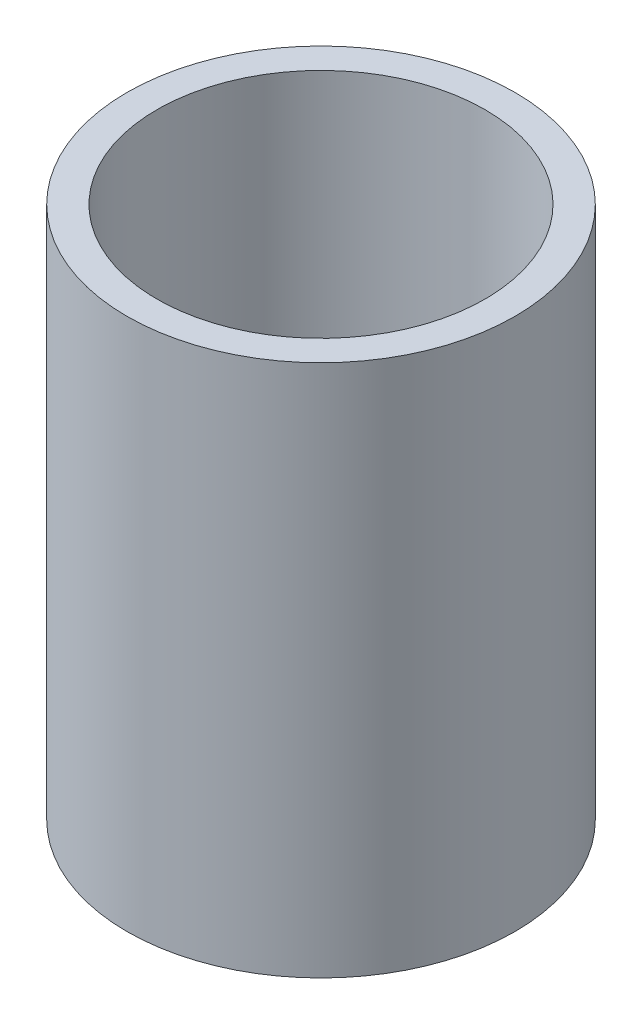
ISO-10303-21;
HEADER;
FILE_DESCRIPTION(('STEP AP214'),'2;1');
FILE_NAME('part.step','',(''),(''),'','','');
FILE_SCHEMA(('AUTOMOTIVE_DESIGN { 1 0 10303 214 1 1 1 1 }'));
ENDSEC;
DATA;
#1=APPLICATION_CONTEXT('core data for automotive mechanical design processes');
#2=APPLICATION_PROTOCOL_DEFINITION('international standard','automotive_design',2000,#1);
#3=PRODUCT_CONTEXT('',#1,'mechanical');
#4=PRODUCT('Part','Part','',(#3));
#5=PRODUCT_RELATED_PRODUCT_CATEGORY('part','',(#4));
#6=PRODUCT_DEFINITION_FORMATION('','',#4);
#7=PRODUCT_DEFINITION_CONTEXT('part definition',#1,'design');
#8=PRODUCT_DEFINITION('design','',#6,#7);
#9=PRODUCT_DEFINITION_SHAPE('','',#8);
#10=(LENGTH_UNIT() NAMED_UNIT(*) SI_UNIT(.MILLI.,.METRE.));
#11=(NAMED_UNIT(*) PLANE_ANGLE_UNIT() SI_UNIT($,.RADIAN.));
#12=(NAMED_UNIT(*) SI_UNIT($,.STERADIAN.) SOLID_ANGLE_UNIT());
#13=UNCERTAINTY_MEASURE_WITH_UNIT(LENGTH_MEASURE(1.E-05),#10,'distance_accuracy_value','');
#14=(GEOMETRIC_REPRESENTATION_CONTEXT(3) GLOBAL_UNCERTAINTY_ASSIGNED_CONTEXT((#13)) GLOBAL_UNIT_ASSIGNED_CONTEXT((#10,
#11,#12)) REPRESENTATION_CONTEXT('',''));
#15=CARTESIAN_POINT('',(0.,0.,0.));
#16=DIRECTION('',(0.,0.,1.));
#17=DIRECTION('',(1.,0.,0.));
#18=AXIS2_PLACEMENT_3D('',#15,#16,#17);
#19=CARTESIAN_POINT('',(0.,157.949440907896,0.));
#20=DIRECTION('',(0.,-1.,0.));
#21=DIRECTION('',(0.,0.,-1.));
#22=AXIS2_PLACEMENT_3D('',#19,#20,#21);
#23=CYLINDRICAL_SURFACE('',#22,57.5);
#24=CARTESIAN_POINT('',(0.,157.949440907896,0.));
#25=DIRECTION('',(0.,1.,0.));
#26=DIRECTION('',(0.,0.,1.));
#27=AXIS2_PLACEMENT_3D('',#24,#25,#26);
#28=CIRCLE('',#27,57.5);
#29=CARTESIAN_POINT('',(0.,157.949440907896,-57.5));
#30=VERTEX_POINT('',#29);
#31=EDGE_CURVE('E10',#30,#30,#28,.T.);
#32=CARTESIAN_POINT('',(0.,0.,0.));
#33=DIRECTION('',(0.,1.,0.));
#34=DIRECTION('',(0.,0.,1.));
#35=AXIS2_PLACEMENT_3D('',#32,#33,#34);
#36=CIRCLE('',#35,57.5);
#37=CARTESIAN_POINT('',(0.,0.,-57.5));
#38=VERTEX_POINT('',#37);
#39=EDGE_CURVE('E37',#38,#38,#36,.T.);
#40=CARTESIAN_POINT('',(0.,157.949440907896,-57.5));
#41=CARTESIAN_POINT('',(0.,156.304134231772,-57.5));
#42=CARTESIAN_POINT('',(0.,154.658827555648,-57.5));
#43=CARTESIAN_POINT('',(0.,151.368214203401,-57.5));
#44=CARTESIAN_POINT('',(0.,149.722907527277,-57.5));
#45=CARTESIAN_POINT('',(0.,146.432294175029,-57.5));
#46=CARTESIAN_POINT('',(0.,144.786987498905,-57.5));
#47=CARTESIAN_POINT('',(0.,141.496374146657,-57.5));
#48=CARTESIAN_POINT('',(0.,139.851067470533,-57.5));
#49=CARTESIAN_POINT('',(0.,136.560454118285,-57.5));
#50=CARTESIAN_POINT('',(0.,134.915147442161,-57.5));
#51=CARTESIAN_POINT('',(0.,131.624534089914,-57.5));
#52=CARTESIAN_POINT('',(0.,129.97922741379,-57.5));
#53=CARTESIAN_POINT('',(0.,126.688614061542,-57.5));
#54=CARTESIAN_POINT('',(0.,125.043307385418,-57.5));
#55=CARTESIAN_POINT('',(0.,121.75269403317,-57.5));
#56=CARTESIAN_POINT('',(0.,120.107387357046,-57.5));
#57=CARTESIAN_POINT('',(0.,116.816774004798,-57.5));
#58=CARTESIAN_POINT('',(0.,115.171467328674,-57.5));
#59=CARTESIAN_POINT('',(0.,111.880853976427,-57.5));
#60=CARTESIAN_POINT('',(0.,110.235547300303,-57.5));
#61=CARTESIAN_POINT('',(0.,106.944933948055,-57.5));
#62=CARTESIAN_POINT('',(0.,105.299627271931,-57.5));
#63=CARTESIAN_POINT('',(0.,102.009013919683,-57.5));
#64=CARTESIAN_POINT('',(0.,100.363707243559,-57.5));
#65=CARTESIAN_POINT('',(0.,97.0730938913113,-57.5));
#66=CARTESIAN_POINT('',(0.,95.4277872151874,-57.5));
#67=CARTESIAN_POINT('',(0.,92.1371738629395,-57.5));
#68=CARTESIAN_POINT('',(0.,90.4918671868156,-57.5));
#69=CARTESIAN_POINT('',(0.,87.2012538345678,-57.5));
#70=CARTESIAN_POINT('',(0.,85.5559471584438,-57.5));
#71=CARTESIAN_POINT('',(0.,82.265333806196,-57.5));
#72=CARTESIAN_POINT('',(0.,80.6200271300721,-57.5));
#73=CARTESIAN_POINT('',(0.,77.3294137778242,-57.5));
#74=CARTESIAN_POINT('',(0.,75.6841071017003,-57.5));
#75=CARTESIAN_POINT('',(0.,72.3934937494525,-57.5));
#76=CARTESIAN_POINT('',(0.,70.7481870733286,-57.5));
#77=CARTESIAN_POINT('',(0.,67.4575737210807,-57.5));
#78=CARTESIAN_POINT('',(0.,65.8122670449568,-57.5));
#79=CARTESIAN_POINT('',(0.,62.521653692709,-57.5));
#80=CARTESIAN_POINT('',(0.,60.876347016585,-57.5));
#81=CARTESIAN_POINT('',(0.,57.5857336643372,-57.5));
#82=CARTESIAN_POINT('',(0.,55.9404269882133,-57.5));
#83=CARTESIAN_POINT('',(0.,52.6498136359654,-57.5));
#84=CARTESIAN_POINT('',(0.,51.0045069598415,-57.5));
#85=CARTESIAN_POINT('',(0.,47.7138936075937,-57.5));
#86=CARTESIAN_POINT('',(0.,46.0685869314698,-57.5));
#87=CARTESIAN_POINT('',(0.,42.7779735792219,-57.5));
#88=CARTESIAN_POINT('',(0.,41.132666903098,-57.5));
#89=CARTESIAN_POINT('',(0.,37.8420535508502,-57.5));
#90=CARTESIAN_POINT('',(0.,36.1967468747262,-57.5));
#91=CARTESIAN_POINT('',(0.,32.9061335224784,-57.5));
#92=CARTESIAN_POINT('',(0.,31.2608268463545,-57.5));
#93=CARTESIAN_POINT('',(0.,27.9702134941066,-57.5));
#94=CARTESIAN_POINT('',(0.,26.3249068179827,-57.5));
#95=CARTESIAN_POINT('',(0.,23.0342934657349,-57.5));
#96=CARTESIAN_POINT('',(0.,21.3889867896109,-57.5));
#97=CARTESIAN_POINT('',(0.,18.0983734373631,-57.5));
#98=CARTESIAN_POINT('',(0.,16.4530667612392,-57.5));
#99=CARTESIAN_POINT('',(0.,13.1624534089913,-57.5));
#100=CARTESIAN_POINT('',(0.,11.5171467328674,-57.5));
#101=CARTESIAN_POINT('',(0.,8.22653338061957,-57.5));
#102=CARTESIAN_POINT('',(0.,6.58122670449565,-57.5));
#103=CARTESIAN_POINT('',(0.,3.29061335224781,-57.5));
#104=CARTESIAN_POINT('',(0.,1.64530667612389,-57.5));
#105=CARTESIAN_POINT('',(0.,0.,-57.5));
#106=B_SPLINE_CURVE_WITH_KNOTS('',3,(#40,#41,#42,#43,#44,#45,#46,#47,#48,#49,#50,#51,#52,#53,
#54,#55,#56,#57,#58,#59,#60,#61,#62,#63,#64,#65,#66,#67,#68,#69,#70,#71,#72,#73,#74,#75,#76,#77,
#78,#79,#80,#81,#82,#83,#84,#85,#86,#87,#88,#89,#90,#91,#92,#93,#94,#95,#96,#97,#98,#99,#100,
#101,#102,#103,#104,#105),.UNSPECIFIED.,.F.,.F.,(4,2,2,2,2,2,2,2,2,2,2,2,2,2,2,2,2,2,2,2,2,2,2,
2,2,2,2,2,2,2,2,2,4),(0.,4.93592002837176,9.87184005674352,14.8077600851153,19.743680113487,
24.6796001418588,29.6155201702306,34.5514401986023,39.4873602269741,44.4232802553458,
49.3592002837176,54.2951203120894,59.2310403404611,64.1669603688329,69.1028803972046,
74.0388004255764,78.9747204539482,83.9106404823199,88.8465605106917,93.7824805390635,
98.7184005674352,103.654320595807,108.590240624179,113.526160652551,118.462080680922,
123.398000709294,128.333920737666,133.269840766038,138.205760794409,143.141680822781,
148.077600851153,153.013520879525,157.949440907896),.UNSPECIFIED.);
#107=EDGE_CURVE('BSEAM40',#30,#38,#106,.T.);
#108=ORIENTED_EDGE('',*,*,#31,.F.);
#109=ORIENTED_EDGE('',*,*,#39,.T.);
#110=ORIENTED_EDGE('',*,*,#107,.T.);
#111=ORIENTED_EDGE('',*,*,#107,.F.);
#112=EDGE_LOOP('',(#108,#110,#109,#111));
#113=FACE_BOUND('',#112,.T.);
#114=ADVANCED_FACE('F40',(#113),#23,.T.);
#115=CARTESIAN_POINT('',(0.,157.949440907896,0.));
#116=DIRECTION('',(0.,1.,0.));
#117=DIRECTION('',(0.,0.,1.));
#118=AXIS2_PLACEMENT_3D('',#115,#116,#117);
#119=PLANE('',#118);
#120=CARTESIAN_POINT('',(0.,157.949440907896,0.));
#121=DIRECTION('',(0.,1.,0.));
#122=DIRECTION('',(0.,0.,1.));
#123=AXIS2_PLACEMENT_3D('',#120,#121,#122);
#124=CIRCLE('',#123,48.643122739986);
#125=CARTESIAN_POINT('',(0.,157.949440907896,-48.643122739986));
#126=VERTEX_POINT('',#125);
#127=EDGE_CURVE('E50',#126,#126,#124,.T.);
#128=ORIENTED_EDGE('',*,*,#127,.F.);
#129=EDGE_LOOP('',(#128));
#130=FACE_BOUND('',#129,.T.);
#131=ORIENTED_EDGE('',*,*,#31,.T.);
#132=EDGE_LOOP('',(#131));
#133=FACE_BOUND('',#132,.T.);
#134=ADVANCED_FACE('F59',(#130,#133),#119,.T.);
#135=CARTESIAN_POINT('',(0.,0.,0.));
#136=DIRECTION('',(0.,1.,0.));
#137=DIRECTION('',(0.,0.,1.));
#138=AXIS2_PLACEMENT_3D('',#135,#136,#137);
#139=PLANE('',#138);
#140=CARTESIAN_POINT('',(0.,0.,0.));
#141=DIRECTION('',(0.,1.,0.));
#142=DIRECTION('',(0.,0.,1.));
#143=AXIS2_PLACEMENT_3D('',#140,#141,#142);
#144=CIRCLE('',#143,48.643122739986);
#145=CARTESIAN_POINT('',(0.,0.,-48.643122739986));
#146=VERTEX_POINT('',#145);
#147=EDGE_CURVE('E47',#146,#146,#144,.T.);
#148=ORIENTED_EDGE('',*,*,#147,.T.);
#149=EDGE_LOOP('',(#148));
#150=FACE_BOUND('',#149,.T.);
#151=ORIENTED_EDGE('',*,*,#39,.F.);
#152=EDGE_LOOP('',(#151));
#153=FACE_BOUND('',#152,.T.);
#154=ADVANCED_FACE('F58',(#150,#153),#139,.F.);
#155=CARTESIAN_POINT('',(0.,157.949440907896,0.));
#156=DIRECTION('',(0.,-1.,0.));
#157=DIRECTION('',(0.,0.,-1.));
#158=AXIS2_PLACEMENT_3D('',#155,#156,#157);
#159=CYLINDRICAL_SURFACE('',#158,48.643122739986);
#160=CARTESIAN_POINT('',(0.,157.949440907896,-48.643122739986));
#161=CARTESIAN_POINT('',(0.,156.304134231772,-48.643122739986));
#162=CARTESIAN_POINT('',(0.,154.658827555648,-48.643122739986));
#163=CARTESIAN_POINT('',(0.,151.368214203401,-48.643122739986));
#164=CARTESIAN_POINT('',(0.,149.722907527277,-48.643122739986));
#165=CARTESIAN_POINT('',(0.,146.432294175029,-48.643122739986));
#166=CARTESIAN_POINT('',(0.,144.786987498905,-48.643122739986));
#167=CARTESIAN_POINT('',(0.,141.496374146657,-48.643122739986));
#168=CARTESIAN_POINT('',(0.,139.851067470533,-48.643122739986));
#169=CARTESIAN_POINT('',(0.,136.560454118285,-48.643122739986));
#170=CARTESIAN_POINT('',(0.,134.915147442161,-48.643122739986));
#171=CARTESIAN_POINT('',(0.,131.624534089914,-48.643122739986));
#172=CARTESIAN_POINT('',(0.,129.97922741379,-48.643122739986));
#173=CARTESIAN_POINT('',(0.,126.688614061542,-48.643122739986));
#174=CARTESIAN_POINT('',(0.,125.043307385418,-48.643122739986));
#175=CARTESIAN_POINT('',(0.,121.75269403317,-48.643122739986));
#176=CARTESIAN_POINT('',(0.,120.107387357046,-48.643122739986));
#177=CARTESIAN_POINT('',(0.,116.816774004798,-48.643122739986));
#178=CARTESIAN_POINT('',(0.,115.171467328674,-48.643122739986));
#179=CARTESIAN_POINT('',(0.,111.880853976427,-48.643122739986));
#180=CARTESIAN_POINT('',(0.,110.235547300303,-48.643122739986));
#181=CARTESIAN_POINT('',(0.,106.944933948055,-48.643122739986));
#182=CARTESIAN_POINT('',(0.,105.299627271931,-48.643122739986));
#183=CARTESIAN_POINT('',(0.,102.009013919683,-48.643122739986));
#184=CARTESIAN_POINT('',(0.,100.363707243559,-48.643122739986));
#185=CARTESIAN_POINT('',(0.,97.0730938913113,-48.643122739986));
#186=CARTESIAN_POINT('',(0.,95.4277872151874,-48.643122739986));
#187=CARTESIAN_POINT('',(0.,92.1371738629395,-48.643122739986));
#188=CARTESIAN_POINT('',(0.,90.4918671868156,-48.643122739986));
#189=CARTESIAN_POINT('',(0.,87.2012538345678,-48.643122739986));
#190=CARTESIAN_POINT('',(0.,85.5559471584438,-48.643122739986));
#191=CARTESIAN_POINT('',(0.,82.265333806196,-48.643122739986));
#192=CARTESIAN_POINT('',(0.,80.6200271300721,-48.643122739986));
#193=CARTESIAN_POINT('',(0.,77.3294137778242,-48.643122739986));
#194=CARTESIAN_POINT('',(0.,75.6841071017003,-48.643122739986));
#195=CARTESIAN_POINT('',(0.,72.3934937494525,-48.643122739986));
#196=CARTESIAN_POINT('',(0.,70.7481870733286,-48.643122739986));
#197=CARTESIAN_POINT('',(0.,67.4575737210807,-48.643122739986));
#198=CARTESIAN_POINT('',(0.,65.8122670449568,-48.643122739986));
#199=CARTESIAN_POINT('',(0.,62.5216536927089,-48.643122739986));
#200=CARTESIAN_POINT('',(0.,60.876347016585,-48.643122739986));
#201=CARTESIAN_POINT('',(0.,57.5857336643372,-48.643122739986));
#202=CARTESIAN_POINT('',(0.,55.9404269882133,-48.643122739986));
#203=CARTESIAN_POINT('',(0.,52.6498136359654,-48.643122739986));
#204=CARTESIAN_POINT('',(0.,51.0045069598415,-48.643122739986));
#205=CARTESIAN_POINT('',(0.,47.7138936075936,-48.643122739986));
#206=CARTESIAN_POINT('',(0.,46.0685869314697,-48.643122739986));
#207=CARTESIAN_POINT('',(0.,42.7779735792219,-48.643122739986));
#208=CARTESIAN_POINT('',(0.,41.132666903098,-48.643122739986));
#209=CARTESIAN_POINT('',(0.,37.8420535508501,-48.643122739986));
#210=CARTESIAN_POINT('',(0.,36.1967468747262,-48.643122739986));
#211=CARTESIAN_POINT('',(0.,32.9061335224784,-48.643122739986));
#212=CARTESIAN_POINT('',(0.,31.2608268463545,-48.643122739986));
#213=CARTESIAN_POINT('',(0.,27.9702134941066,-48.643122739986));
#214=CARTESIAN_POINT('',(0.,26.3249068179827,-48.643122739986));
#215=CARTESIAN_POINT('',(0.,23.0342934657349,-48.643122739986));
#216=CARTESIAN_POINT('',(0.,21.3889867896109,-48.643122739986));
#217=CARTESIAN_POINT('',(0.,18.0983734373631,-48.643122739986));
#218=CARTESIAN_POINT('',(0.,16.4530667612392,-48.643122739986));
#219=CARTESIAN_POINT('',(0.,13.1624534089913,-48.643122739986));
#220=CARTESIAN_POINT('',(0.,11.5171467328674,-48.643122739986));
#221=CARTESIAN_POINT('',(0.,8.22653338061957,-48.643122739986));
#222=CARTESIAN_POINT('',(0.,6.58122670449565,-48.643122739986));
#223=CARTESIAN_POINT('',(0.,3.29061335224781,-48.643122739986));
#224=CARTESIAN_POINT('',(0.,1.64530667612389,-48.643122739986));
#225=CARTESIAN_POINT('',(0.,0.,-48.643122739986));
#226=B_SPLINE_CURVE_WITH_KNOTS('',3,(#160,#161,#162,#163,#164,#165,#166,#167,#168,#169,#170,
#171,#172,#173,#174,#175,#176,#177,#178,#179,#180,#181,#182,#183,#184,#185,#186,#187,#188,#189,
#190,#191,#192,#193,#194,#195,#196,#197,#198,#199,#200,#201,#202,#203,#204,#205,#206,#207,#208,
#209,#210,#211,#212,#213,#214,#215,#216,#217,#218,#219,#220,#221,#222,#223,#224,#225),
.UNSPECIFIED.,.F.,.F.,(4,2,2,2,2,2,2,2,2,2,2,2,2,2,2,2,2,2,2,2,2,2,2,2,2,2,2,2,2,2,2,2,4),(0.,
4.93592002837179,9.87184005674355,14.8077600851153,19.7436801134871,24.6796001418588,
29.6155201702306,34.5514401986023,39.4873602269741,44.4232802553459,49.3592002837176,
54.2951203120894,59.2310403404612,64.1669603688329,69.1028803972047,74.0388004255765,
78.9747204539482,83.91064048232,88.8465605106917,93.7824805390635,98.7184005674353,
103.654320595807,108.590240624179,113.526160652551,118.462080680922,123.398000709294,
128.333920737666,133.269840766038,138.205760794409,143.141680822781,148.077600851153,
153.013520879525,157.949440907896),.UNSPECIFIED.);
#227=EDGE_CURVE('BSEAM54',#126,#146,#226,.T.);
#228=ORIENTED_EDGE('',*,*,#127,.T.);
#229=ORIENTED_EDGE('',*,*,#147,.F.);
#230=ORIENTED_EDGE('',*,*,#227,.T.);
#231=ORIENTED_EDGE('',*,*,#227,.F.);
#232=EDGE_LOOP('',(#228,#230,#229,#231));
#233=FACE_BOUND('',#232,.T.);
#234=ADVANCED_FACE('F54',(#233),#159,.F.);
#235=CLOSED_SHELL('',(#114,#134,#154,#234));
#236=MANIFOLD_SOLID_BREP('B2',#235);
#237=ADVANCED_BREP_SHAPE_REPRESENTATION('',(#18,#236),#14);
#238=SHAPE_DEFINITION_REPRESENTATION(#9,#237);
ENDSEC;
END-ISO-10303-21;
